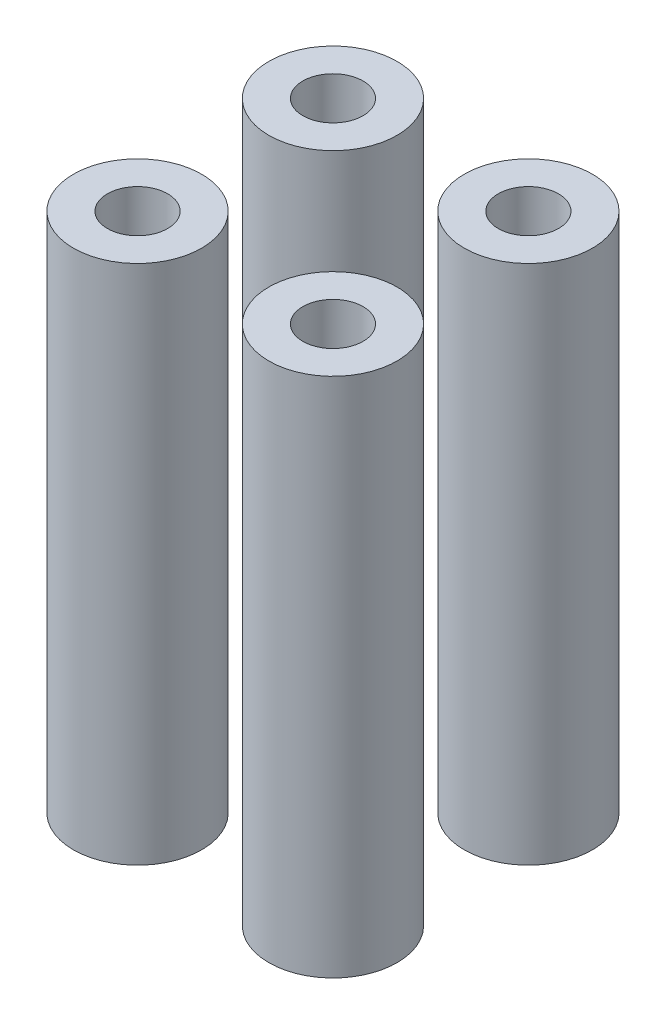
ISO-10303-21;
HEADER;
FILE_DESCRIPTION(('STEP AP214'),'2;1');
FILE_NAME('part.step','',(''),(''),'','','');
FILE_SCHEMA(('AUTOMOTIVE_DESIGN { 1 0 10303 214 1 1 1 1 }'));
ENDSEC;
DATA;
#1=APPLICATION_CONTEXT('core data for automotive mechanical design processes');
#2=APPLICATION_PROTOCOL_DEFINITION('international standard','automotive_design',2000,#1);
#3=PRODUCT_CONTEXT('',#1,'mechanical');
#4=PRODUCT('Part','Part','',(#3));
#5=PRODUCT_RELATED_PRODUCT_CATEGORY('part','',(#4));
#6=PRODUCT_DEFINITION_FORMATION('','',#4);
#7=PRODUCT_DEFINITION_CONTEXT('part definition',#1,'design');
#8=PRODUCT_DEFINITION('design','',#6,#7);
#9=PRODUCT_DEFINITION_SHAPE('','',#8);
#10=(LENGTH_UNIT() NAMED_UNIT(*) SI_UNIT(.MILLI.,.METRE.));
#11=(NAMED_UNIT(*) PLANE_ANGLE_UNIT() SI_UNIT($,.RADIAN.));
#12=(NAMED_UNIT(*) SI_UNIT($,.STERADIAN.) SOLID_ANGLE_UNIT());
#13=UNCERTAINTY_MEASURE_WITH_UNIT(LENGTH_MEASURE(1.E-05),#10,'distance_accuracy_value','');
#14=(GEOMETRIC_REPRESENTATION_CONTEXT(3) GLOBAL_UNCERTAINTY_ASSIGNED_CONTEXT((#13)) GLOBAL_UNIT_ASSIGNED_CONTEXT((#10,
#11,#12)) REPRESENTATION_CONTEXT('',''));
#15=CARTESIAN_POINT('',(0.,0.,0.));
#16=DIRECTION('',(0.,0.,1.));
#17=DIRECTION('',(1.,0.,0.));
#18=AXIS2_PLACEMENT_3D('',#15,#16,#17);
#19=CARTESIAN_POINT('',(7.62,20.32,7.62));
#20=DIRECTION('',(0.,-1.,0.));
#21=DIRECTION('',(0.,0.,-1.));
#22=AXIS2_PLACEMENT_3D('',#19,#20,#21);
#23=CYLINDRICAL_SURFACE('',#22,2.5);
#24=CARTESIAN_POINT('',(7.62,20.32,7.62));
#25=DIRECTION('',(0.,1.,0.));
#26=DIRECTION('',(0.,0.,1.));
#27=AXIS2_PLACEMENT_3D('',#24,#25,#26);
#28=CIRCLE('',#27,2.5);
#29=CARTESIAN_POINT('',(7.62,20.32,10.12));
#30=VERTEX_POINT('',#29);
#31=EDGE_CURVE('E11',#30,#30,#28,.T.);
#32=ORIENTED_EDGE('',*,*,#31,.F.);
#33=EDGE_LOOP('',(#32));
#34=FACE_BOUND('',#33,.T.);
#35=CARTESIAN_POINT('',(7.62,0.,7.62));
#36=DIRECTION('',(0.,1.,0.));
#37=DIRECTION('',(0.,0.,1.));
#38=AXIS2_PLACEMENT_3D('',#35,#36,#37);
#39=CIRCLE('',#38,2.5);
#40=CARTESIAN_POINT('',(7.62,0.,10.12));
#41=VERTEX_POINT('',#40);
#42=EDGE_CURVE('E49',#41,#41,#39,.T.);
#43=ORIENTED_EDGE('',*,*,#42,.T.);
#44=EDGE_LOOP('',(#43));
#45=FACE_BOUND('',#44,.T.);
#46=ADVANCED_FACE('F46',(#34,#45),#23,.T.);
#47=CARTESIAN_POINT('',(7.62,20.32,7.62));
#48=DIRECTION('',(0.,1.,0.));
#49=DIRECTION('',(0.,0.,1.));
#50=AXIS2_PLACEMENT_3D('',#47,#48,#49);
#51=PLANE('',#50);
#52=CARTESIAN_POINT('',(7.62,20.32,7.62));
#53=DIRECTION('',(0.,1.,0.));
#54=DIRECTION('',(0.,0.,1.));
#55=AXIS2_PLACEMENT_3D('',#52,#53,#54);
#56=CIRCLE('',#55,1.175);
#57=CARTESIAN_POINT('',(7.62,20.32,8.795));
#58=VERTEX_POINT('',#57);
#59=EDGE_CURVE('E58',#58,#58,#56,.T.);
#60=ORIENTED_EDGE('',*,*,#59,.F.);
#61=EDGE_LOOP('',(#60));
#62=FACE_BOUND('',#61,.T.);
#63=ORIENTED_EDGE('',*,*,#31,.T.);
#64=EDGE_LOOP('',(#63));
#65=FACE_BOUND('',#64,.T.);
#66=ADVANCED_FACE('F73',(#62,#65),#51,.T.);
#67=CARTESIAN_POINT('',(7.62,0.,7.62));
#68=DIRECTION('',(0.,1.,0.));
#69=DIRECTION('',(0.,0.,1.));
#70=AXIS2_PLACEMENT_3D('',#67,#68,#69);
#71=PLANE('',#70);
#72=ORIENTED_EDGE('',*,*,#42,.F.);
#73=EDGE_LOOP('',(#72));
#74=FACE_BOUND('',#73,.T.);
#75=ADVANCED_FACE('F69',(#74),#71,.F.);
#76=CARTESIAN_POINT('',(7.62,13.97,7.62));
#77=DIRECTION('',(0.,1.,0.));
#78=DIRECTION('',(0.,0.,1.));
#79=AXIS2_PLACEMENT_3D('',#76,#77,#78);
#80=CYLINDRICAL_SURFACE('',#79,1.175);
#81=CARTESIAN_POINT('',(7.62,13.97,7.62));
#82=DIRECTION('',(0.,1.,0.));
#83=DIRECTION('',(0.,0.,1.));
#84=AXIS2_PLACEMENT_3D('',#81,#82,#83);
#85=CIRCLE('',#84,1.175);
#86=CARTESIAN_POINT('',(7.62,13.97,8.795));
#87=VERTEX_POINT('',#86);
#88=EDGE_CURVE('E56',#87,#87,#85,.T.);
#89=ORIENTED_EDGE('',*,*,#88,.F.);
#90=EDGE_LOOP('',(#89));
#91=FACE_BOUND('',#90,.T.);
#92=ORIENTED_EDGE('',*,*,#59,.T.);
#93=EDGE_LOOP('',(#92));
#94=FACE_BOUND('',#93,.T.);
#95=ADVANCED_FACE('F66',(#91,#94),#80,.F.);
#96=CARTESIAN_POINT('',(7.62,13.97,7.62));
#97=DIRECTION('',(0.,1.,0.));
#98=DIRECTION('',(0.,0.,1.));
#99=AXIS2_PLACEMENT_3D('',#96,#97,#98);
#100=PLANE('',#99);
#101=ORIENTED_EDGE('',*,*,#88,.T.);
#102=EDGE_LOOP('',(#101));
#103=FACE_BOUND('',#102,.T.);
#104=ADVANCED_FACE('F64',(#103),#100,.T.);
#105=CLOSED_SHELL('',(#46,#66,#75,#95,#104));
#106=MANIFOLD_SOLID_BREP('B2',#105);
#107=CARTESIAN_POINT('',(7.62,20.32,0.));
#108=DIRECTION('',(0.,-1.,0.));
#109=DIRECTION('',(0.,0.,-1.));
#110=AXIS2_PLACEMENT_3D('',#107,#108,#109);
#111=CYLINDRICAL_SURFACE('',#110,2.5);
#112=CARTESIAN_POINT('',(7.62,20.32,0.));
#113=DIRECTION('',(0.,1.,0.));
#114=DIRECTION('',(0.,0.,1.));
#115=AXIS2_PLACEMENT_3D('',#112,#113,#114);
#116=CIRCLE('',#115,2.5);
#117=CARTESIAN_POINT('',(7.62,20.32,2.5));
#118=VERTEX_POINT('',#117);
#119=EDGE_CURVE('E45',#118,#118,#116,.T.);
#120=ORIENTED_EDGE('',*,*,#119,.F.);
#121=EDGE_LOOP('',(#120));
#122=FACE_BOUND('',#121,.T.);
#123=CARTESIAN_POINT('',(7.62,0.,0.));
#124=DIRECTION('',(0.,1.,0.));
#125=DIRECTION('',(0.,0.,1.));
#126=AXIS2_PLACEMENT_3D('',#123,#124,#125);
#127=CIRCLE('',#126,2.5);
#128=CARTESIAN_POINT('',(7.62,0.,2.5));
#129=VERTEX_POINT('',#128);
#130=EDGE_CURVE('E128',#129,#129,#127,.T.);
#131=ORIENTED_EDGE('',*,*,#130,.T.);
#132=EDGE_LOOP('',(#131));
#133=FACE_BOUND('',#132,.T.);
#134=ADVANCED_FACE('F125',(#122,#133),#111,.T.);
#135=CARTESIAN_POINT('',(7.62,20.32,0.));
#136=DIRECTION('',(0.,1.,0.));
#137=DIRECTION('',(0.,0.,1.));
#138=AXIS2_PLACEMENT_3D('',#135,#136,#137);
#139=PLANE('',#138);
#140=CARTESIAN_POINT('',(7.62,20.32,0.));
#141=DIRECTION('',(0.,1.,0.));
#142=DIRECTION('',(0.,0.,1.));
#143=AXIS2_PLACEMENT_3D('',#140,#141,#142);
#144=CIRCLE('',#143,1.175);
#145=CARTESIAN_POINT('',(7.62,20.32,1.175));
#146=VERTEX_POINT('',#145);
#147=EDGE_CURVE('E139',#146,#146,#144,.T.);
#148=ORIENTED_EDGE('',*,*,#147,.F.);
#149=EDGE_LOOP('',(#148));
#150=FACE_BOUND('',#149,.T.);
#151=ORIENTED_EDGE('',*,*,#119,.T.);
#152=EDGE_LOOP('',(#151));
#153=FACE_BOUND('',#152,.T.);
#154=ADVANCED_FACE('F156',(#150,#153),#139,.T.);
#155=CARTESIAN_POINT('',(7.62,0.,0.));
#156=DIRECTION('',(0.,1.,0.));
#157=DIRECTION('',(0.,0.,1.));
#158=AXIS2_PLACEMENT_3D('',#155,#156,#157);
#159=PLANE('',#158);
#160=ORIENTED_EDGE('',*,*,#130,.F.);
#161=EDGE_LOOP('',(#160));
#162=FACE_BOUND('',#161,.T.);
#163=ADVANCED_FACE('F152',(#162),#159,.F.);
#164=CARTESIAN_POINT('',(7.62,13.97,0.));
#165=DIRECTION('',(0.,1.,0.));
#166=DIRECTION('',(0.,0.,1.));
#167=AXIS2_PLACEMENT_3D('',#164,#165,#166);
#168=CYLINDRICAL_SURFACE('',#167,1.175);
#169=CARTESIAN_POINT('',(7.62,13.97,0.));
#170=DIRECTION('',(0.,1.,0.));
#171=DIRECTION('',(0.,0.,1.));
#172=AXIS2_PLACEMENT_3D('',#169,#170,#171);
#173=CIRCLE('',#172,1.175);
#174=CARTESIAN_POINT('',(7.62,13.97,1.175));
#175=VERTEX_POINT('',#174);
#176=EDGE_CURVE('E137',#175,#175,#173,.T.);
#177=ORIENTED_EDGE('',*,*,#176,.F.);
#178=EDGE_LOOP('',(#177));
#179=FACE_BOUND('',#178,.T.);
#180=ORIENTED_EDGE('',*,*,#147,.T.);
#181=EDGE_LOOP('',(#180));
#182=FACE_BOUND('',#181,.T.);
#183=ADVANCED_FACE('F149',(#179,#182),#168,.F.);
#184=CARTESIAN_POINT('',(7.62,13.97,0.));
#185=DIRECTION('',(0.,1.,0.));
#186=DIRECTION('',(0.,0.,1.));
#187=AXIS2_PLACEMENT_3D('',#184,#185,#186);
#188=PLANE('',#187);
#189=ORIENTED_EDGE('',*,*,#176,.T.);
#190=EDGE_LOOP('',(#189));
#191=FACE_BOUND('',#190,.T.);
#192=ADVANCED_FACE('F147',(#191),#188,.T.);
#193=CLOSED_SHELL('',(#134,#154,#163,#183,#192));
#194=MANIFOLD_SOLID_BREP('B6',#193);
#195=CARTESIAN_POINT('',(0.,20.32,7.62));
#196=DIRECTION('',(0.,-1.,0.));
#197=DIRECTION('',(0.,0.,-1.));
#198=AXIS2_PLACEMENT_3D('',#195,#196,#197);
#199=CYLINDRICAL_SURFACE('',#198,2.5);
#200=CARTESIAN_POINT('',(0.,20.32,7.62));
#201=DIRECTION('',(0.,1.,0.));
#202=DIRECTION('',(0.,0.,1.));
#203=AXIS2_PLACEMENT_3D('',#200,#201,#202);
#204=CIRCLE('',#203,2.5);
#205=CARTESIAN_POINT('',(0.,20.32,10.12));
#206=VERTEX_POINT('',#205);
#207=EDGE_CURVE('E124',#206,#206,#204,.T.);
#208=ORIENTED_EDGE('',*,*,#207,.F.);
#209=EDGE_LOOP('',(#208));
#210=FACE_BOUND('',#209,.T.);
#211=CARTESIAN_POINT('',(0.,0.,7.62));
#212=DIRECTION('',(0.,1.,0.));
#213=DIRECTION('',(0.,0.,1.));
#214=AXIS2_PLACEMENT_3D('',#211,#212,#213);
#215=CIRCLE('',#214,2.5);
#216=CARTESIAN_POINT('',(0.,0.,10.12));
#217=VERTEX_POINT('',#216);
#218=EDGE_CURVE('E210',#217,#217,#215,.T.);
#219=ORIENTED_EDGE('',*,*,#218,.T.);
#220=EDGE_LOOP('',(#219));
#221=FACE_BOUND('',#220,.T.);
#222=ADVANCED_FACE('F207',(#210,#221),#199,.T.);
#223=CARTESIAN_POINT('',(0.,20.32,7.62));
#224=DIRECTION('',(0.,1.,0.));
#225=DIRECTION('',(0.,0.,1.));
#226=AXIS2_PLACEMENT_3D('',#223,#224,#225);
#227=PLANE('',#226);
#228=CARTESIAN_POINT('',(0.,20.32,7.62));
#229=DIRECTION('',(0.,1.,0.));
#230=DIRECTION('',(0.,0.,1.));
#231=AXIS2_PLACEMENT_3D('',#228,#229,#230);
#232=CIRCLE('',#231,1.175);
#233=CARTESIAN_POINT('',(0.,20.32,8.795));
#234=VERTEX_POINT('',#233);
#235=EDGE_CURVE('E219',#234,#234,#232,.T.);
#236=ORIENTED_EDGE('',*,*,#235,.F.);
#237=EDGE_LOOP('',(#236));
#238=FACE_BOUND('',#237,.T.);
#239=ORIENTED_EDGE('',*,*,#207,.T.);
#240=EDGE_LOOP('',(#239));
#241=FACE_BOUND('',#240,.T.);
#242=ADVANCED_FACE('F234',(#238,#241),#227,.T.);
#243=CARTESIAN_POINT('',(0.,0.,7.62));
#244=DIRECTION('',(0.,1.,0.));
#245=DIRECTION('',(0.,0.,1.));
#246=AXIS2_PLACEMENT_3D('',#243,#244,#245);
#247=PLANE('',#246);
#248=ORIENTED_EDGE('',*,*,#218,.F.);
#249=EDGE_LOOP('',(#248));
#250=FACE_BOUND('',#249,.T.);
#251=ADVANCED_FACE('F230',(#250),#247,.F.);
#252=CARTESIAN_POINT('',(0.,13.97,7.62));
#253=DIRECTION('',(0.,1.,0.));
#254=DIRECTION('',(0.,0.,1.));
#255=AXIS2_PLACEMENT_3D('',#252,#253,#254);
#256=CYLINDRICAL_SURFACE('',#255,1.175);
#257=CARTESIAN_POINT('',(0.,13.97,7.62));
#258=DIRECTION('',(0.,1.,0.));
#259=DIRECTION('',(0.,0.,1.));
#260=AXIS2_PLACEMENT_3D('',#257,#258,#259);
#261=CIRCLE('',#260,1.175);
#262=CARTESIAN_POINT('',(0.,13.97,8.795));
#263=VERTEX_POINT('',#262);
#264=EDGE_CURVE('E217',#263,#263,#261,.T.);
#265=ORIENTED_EDGE('',*,*,#264,.F.);
#266=EDGE_LOOP('',(#265));
#267=FACE_BOUND('',#266,.T.);
#268=ORIENTED_EDGE('',*,*,#235,.T.);
#269=EDGE_LOOP('',(#268));
#270=FACE_BOUND('',#269,.T.);
#271=ADVANCED_FACE('F227',(#267,#270),#256,.F.);
#272=CARTESIAN_POINT('',(0.,13.97,7.62));
#273=DIRECTION('',(0.,1.,0.));
#274=DIRECTION('',(0.,0.,1.));
#275=AXIS2_PLACEMENT_3D('',#272,#273,#274);
#276=PLANE('',#275);
#277=ORIENTED_EDGE('',*,*,#264,.T.);
#278=EDGE_LOOP('',(#277));
#279=FACE_BOUND('',#278,.T.);
#280=ADVANCED_FACE('F225',(#279),#276,.T.);
#281=CLOSED_SHELL('',(#222,#242,#251,#271,#280));
#282=MANIFOLD_SOLID_BREP('B40',#281);
#283=CARTESIAN_POINT('',(0.,20.32,0.));
#284=DIRECTION('',(0.,-1.,0.));
#285=DIRECTION('',(0.,0.,-1.));
#286=AXIS2_PLACEMENT_3D('',#283,#284,#285);
#287=CYLINDRICAL_SURFACE('',#286,2.5);
#288=CARTESIAN_POINT('',(0.,20.32,0.));
#289=DIRECTION('',(0.,1.,0.));
#290=DIRECTION('',(0.,0.,1.));
#291=AXIS2_PLACEMENT_3D('',#288,#289,#290);
#292=CIRCLE('',#291,2.5);
#293=CARTESIAN_POINT('',(0.,20.32,2.5));
#294=VERTEX_POINT('',#293);
#295=EDGE_CURVE('E206',#294,#294,#292,.T.);
#296=ORIENTED_EDGE('',*,*,#295,.F.);
#297=EDGE_LOOP('',(#296));
#298=FACE_BOUND('',#297,.T.);
#299=CARTESIAN_POINT('',(0.,0.,0.));
#300=DIRECTION('',(0.,1.,0.));
#301=DIRECTION('',(0.,0.,1.));
#302=AXIS2_PLACEMENT_3D('',#299,#300,#301);
#303=CIRCLE('',#302,2.5);
#304=CARTESIAN_POINT('',(0.,0.,2.5));
#305=VERTEX_POINT('',#304);
#306=EDGE_CURVE('E281',#305,#305,#303,.T.);
#307=ORIENTED_EDGE('',*,*,#306,.T.);
#308=EDGE_LOOP('',(#307));
#309=FACE_BOUND('',#308,.T.);
#310=ADVANCED_FACE('F278',(#298,#309),#287,.T.);
#311=CARTESIAN_POINT('',(0.,20.32,0.));
#312=DIRECTION('',(0.,1.,0.));
#313=DIRECTION('',(0.,0.,1.));
#314=AXIS2_PLACEMENT_3D('',#311,#312,#313);
#315=PLANE('',#314);
#316=CARTESIAN_POINT('',(0.,20.32,0.));
#317=DIRECTION('',(0.,1.,0.));
#318=DIRECTION('',(0.,0.,1.));
#319=AXIS2_PLACEMENT_3D('',#316,#317,#318);
#320=CIRCLE('',#319,1.175);
#321=CARTESIAN_POINT('',(0.,20.32,1.175));
#322=VERTEX_POINT('',#321);
#323=EDGE_CURVE('E290',#322,#322,#320,.T.);
#324=ORIENTED_EDGE('',*,*,#323,.F.);
#325=EDGE_LOOP('',(#324));
#326=FACE_BOUND('',#325,.T.);
#327=ORIENTED_EDGE('',*,*,#295,.T.);
#328=EDGE_LOOP('',(#327));
#329=FACE_BOUND('',#328,.T.);
#330=ADVANCED_FACE('F305',(#326,#329),#315,.T.);
#331=CARTESIAN_POINT('',(0.,0.,0.));
#332=DIRECTION('',(0.,1.,0.));
#333=DIRECTION('',(0.,0.,1.));
#334=AXIS2_PLACEMENT_3D('',#331,#332,#333);
#335=PLANE('',#334);
#336=ORIENTED_EDGE('',*,*,#306,.F.);
#337=EDGE_LOOP('',(#336));
#338=FACE_BOUND('',#337,.T.);
#339=ADVANCED_FACE('F301',(#338),#335,.F.);
#340=CARTESIAN_POINT('',(0.,13.97,0.));
#341=DIRECTION('',(0.,1.,0.));
#342=DIRECTION('',(0.,0.,1.));
#343=AXIS2_PLACEMENT_3D('',#340,#341,#342);
#344=CYLINDRICAL_SURFACE('',#343,1.175);
#345=CARTESIAN_POINT('',(0.,13.97,0.));
#346=DIRECTION('',(0.,1.,0.));
#347=DIRECTION('',(0.,0.,1.));
#348=AXIS2_PLACEMENT_3D('',#345,#346,#347);
#349=CIRCLE('',#348,1.175);
#350=CARTESIAN_POINT('',(0.,13.97,1.175));
#351=VERTEX_POINT('',#350);
#352=EDGE_CURVE('E288',#351,#351,#349,.T.);
#353=ORIENTED_EDGE('',*,*,#352,.F.);
#354=EDGE_LOOP('',(#353));
#355=FACE_BOUND('',#354,.T.);
#356=ORIENTED_EDGE('',*,*,#323,.T.);
#357=EDGE_LOOP('',(#356));
#358=FACE_BOUND('',#357,.T.);
#359=ADVANCED_FACE('F298',(#355,#358),#344,.F.);
#360=CARTESIAN_POINT('',(0.,13.97,0.));
#361=DIRECTION('',(0.,1.,0.));
#362=DIRECTION('',(0.,0.,1.));
#363=AXIS2_PLACEMENT_3D('',#360,#361,#362);
#364=PLANE('',#363);
#365=ORIENTED_EDGE('',*,*,#352,.T.);
#366=EDGE_LOOP('',(#365));
#367=FACE_BOUND('',#366,.T.);
#368=ADVANCED_FACE('F296',(#367),#364,.T.);
#369=CLOSED_SHELL('',(#310,#330,#339,#359,#368));
#370=MANIFOLD_SOLID_BREP('B119',#369);
#371=ADVANCED_BREP_SHAPE_REPRESENTATION('',(#18,#106,#194,#282,#370),#14);
#372=SHAPE_DEFINITION_REPRESENTATION(#9,#371);
ENDSEC;
END-ISO-10303-21;
